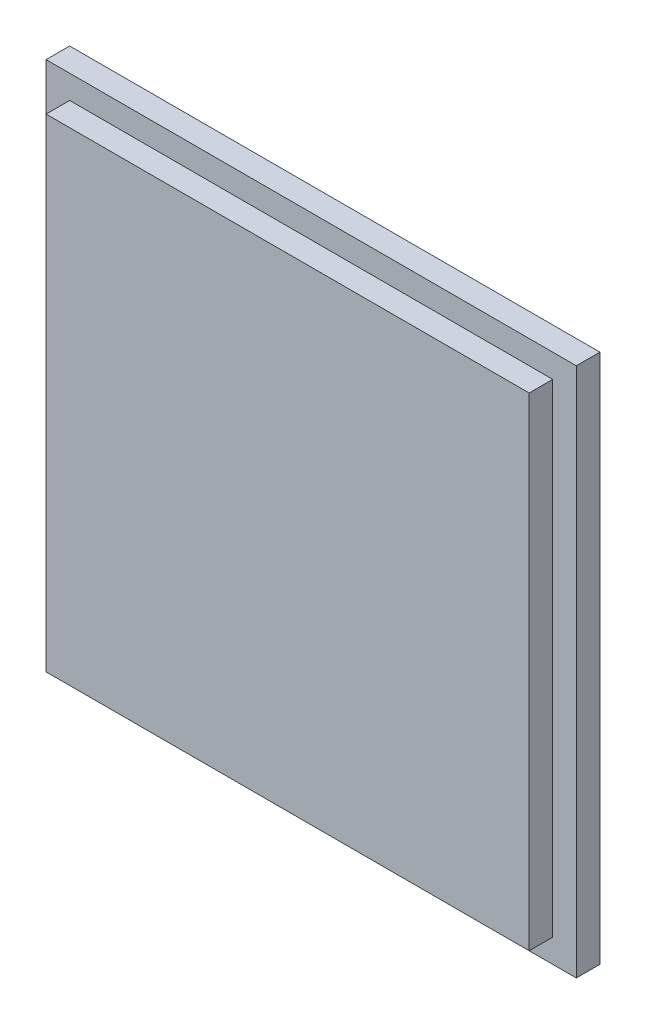
ISO-10303-21;
HEADER;
FILE_DESCRIPTION(('STEP AP214'),'2;1');
FILE_NAME('part.step','',(''),(''),'','','');
FILE_SCHEMA(('AUTOMOTIVE_DESIGN { 1 0 10303 214 1 1 1 1 }'));
ENDSEC;
DATA;
#1=APPLICATION_CONTEXT('core data for automotive mechanical design processes');
#2=APPLICATION_PROTOCOL_DEFINITION('international standard','automotive_design',2000,#1);
#3=PRODUCT_CONTEXT('',#1,'mechanical');
#4=PRODUCT('Part','Part','',(#3));
#5=PRODUCT_RELATED_PRODUCT_CATEGORY('part','',(#4));
#6=PRODUCT_DEFINITION_FORMATION('','',#4);
#7=PRODUCT_DEFINITION_CONTEXT('part definition',#1,'design');
#8=PRODUCT_DEFINITION('design','',#6,#7);
#9=PRODUCT_DEFINITION_SHAPE('','',#8);
#10=(LENGTH_UNIT() NAMED_UNIT(*) SI_UNIT(.MILLI.,.METRE.));
#11=(NAMED_UNIT(*) PLANE_ANGLE_UNIT() SI_UNIT($,.RADIAN.));
#12=(NAMED_UNIT(*) SI_UNIT($,.STERADIAN.) SOLID_ANGLE_UNIT());
#13=UNCERTAINTY_MEASURE_WITH_UNIT(LENGTH_MEASURE(1.E-05),#10,'distance_accuracy_value','');
#14=(GEOMETRIC_REPRESENTATION_CONTEXT(3) GLOBAL_UNCERTAINTY_ASSIGNED_CONTEXT((#13)) GLOBAL_UNIT_ASSIGNED_CONTEXT((#10,
#11,#12)) REPRESENTATION_CONTEXT('',''));
#15=CARTESIAN_POINT('',(0.,0.,0.));
#16=DIRECTION('',(0.,0.,1.));
#17=DIRECTION('',(1.,0.,0.));
#18=AXIS2_PLACEMENT_3D('',#15,#16,#17);
#19=CARTESIAN_POINT('',(0.,0.,2.5));
#20=DIRECTION('',(0.,0.,-1.));
#21=DIRECTION('',(-1.,0.,0.));
#22=AXIS2_PLACEMENT_3D('',#19,#20,#21);
#23=PLANE('',#22);
#24=DIRECTION('',(0.,1.,0.));
#25=VECTOR('',#24,1.);
#26=CARTESIAN_POINT('',(28.1,-28.1,2.5));
#27=LINE('',#26,#25);
#28=CARTESIAN_POINT('',(28.1,-28.1,2.5));
#29=VERTEX_POINT('',#28);
#30=CARTESIAN_POINT('',(28.1,28.1,2.5));
#31=VERTEX_POINT('',#30);
#32=EDGE_CURVE('E130',#29,#31,#27,.T.);
#33=ORIENTED_EDGE('',*,*,#32,.T.);
#34=DIRECTION('',(-1.,0.,0.));
#35=VECTOR('',#34,1.);
#36=CARTESIAN_POINT('',(-28.1,28.1,2.5));
#37=LINE('',#36,#35);
#38=CARTESIAN_POINT('',(-28.1,28.1,2.5));
#39=VERTEX_POINT('',#38);
#40=EDGE_CURVE('E133',#31,#39,#37,.T.);
#41=ORIENTED_EDGE('',*,*,#40,.T.);
#42=DIRECTION('',(0.,-1.,0.));
#43=VECTOR('',#42,1.);
#44=CARTESIAN_POINT('',(-28.1,-28.1,2.5));
#45=LINE('',#44,#43);
#46=CARTESIAN_POINT('',(-28.1,-28.1,2.5));
#47=VERTEX_POINT('',#46);
#48=EDGE_CURVE('E136',#39,#47,#45,.T.);
#49=ORIENTED_EDGE('',*,*,#48,.T.);
#50=DIRECTION('',(1.,0.,0.));
#51=VECTOR('',#50,1.);
#52=CARTESIAN_POINT('',(-28.1,-28.1,2.5));
#53=LINE('',#52,#51);
#54=EDGE_CURVE('E138',#47,#29,#53,.T.);
#55=ORIENTED_EDGE('',*,*,#54,.T.);
#56=EDGE_LOOP('',(#33,#41,#49,#55));
#57=FACE_BOUND('',#56,.T.);
#58=DIRECTION('',(0.,1.,0.));
#59=VECTOR('',#58,1.);
#60=CARTESIAN_POINT('',(25.6,-25.6,2.5));
#61=LINE('',#60,#59);
#62=CARTESIAN_POINT('',(25.6,-25.6,2.5));
#63=VERTEX_POINT('',#62);
#64=CARTESIAN_POINT('',(25.6,25.6,2.5));
#65=VERTEX_POINT('',#64);
#66=EDGE_CURVE('E51',#63,#65,#61,.T.);
#67=ORIENTED_EDGE('',*,*,#66,.F.);
#68=DIRECTION('',(1.,0.,0.));
#69=VECTOR('',#68,1.);
#70=CARTESIAN_POINT('',(-25.6,-25.6,2.5));
#71=LINE('',#70,#69);
#72=CARTESIAN_POINT('',(-25.6,-25.6,2.5));
#73=VERTEX_POINT('',#72);
#74=EDGE_CURVE('E55',#73,#63,#71,.T.);
#75=ORIENTED_EDGE('',*,*,#74,.F.);
#76=DIRECTION('',(0.,-1.,0.));
#77=VECTOR('',#76,1.);
#78=CARTESIAN_POINT('',(-25.6,-25.6,2.5));
#79=LINE('',#78,#77);
#80=CARTESIAN_POINT('',(-25.6,25.6,2.5));
#81=VERTEX_POINT('',#80);
#82=EDGE_CURVE('E263',#81,#73,#79,.T.);
#83=ORIENTED_EDGE('',*,*,#82,.F.);
#84=DIRECTION('',(-1.,0.,0.));
#85=VECTOR('',#84,1.);
#86=CARTESIAN_POINT('',(-25.6,25.6,2.5));
#87=LINE('',#86,#85);
#88=EDGE_CURVE('E269',#65,#81,#87,.T.);
#89=ORIENTED_EDGE('',*,*,#88,.F.);
#90=EDGE_LOOP('',(#67,#75,#83,#89));
#91=FACE_BOUND('',#90,.T.);
#92=ADVANCED_FACE('F36',(#57,#91),#23,.F.);
#93=CARTESIAN_POINT('',(28.1,-28.1,2.5));
#94=DIRECTION('',(-1.,0.,0.));
#95=DIRECTION('',(0.,0.,1.));
#96=AXIS2_PLACEMENT_3D('',#93,#94,#95);
#97=PLANE('',#96);
#98=DIRECTION('',(0.,1.,0.));
#99=VECTOR('',#98,1.);
#100=CARTESIAN_POINT('',(28.1,-28.1,0.));
#101=LINE('',#100,#99);
#102=CARTESIAN_POINT('',(28.1,-28.1,0.));
#103=VERTEX_POINT('',#102);
#104=CARTESIAN_POINT('',(28.1,28.1,0.));
#105=VERTEX_POINT('',#104);
#106=EDGE_CURVE('E121',#103,#105,#101,.T.);
#107=ORIENTED_EDGE('',*,*,#106,.T.);
#108=DIRECTION('',(0.,0.,-1.));
#109=VECTOR('',#108,1.);
#110=CARTESIAN_POINT('',(28.1,28.1,2.5));
#111=LINE('',#110,#109);
#112=EDGE_CURVE('E11',#31,#105,#111,.T.);
#113=ORIENTED_EDGE('',*,*,#112,.F.);
#114=ORIENTED_EDGE('',*,*,#32,.F.);
#115=DIRECTION('',(0.,0.,-1.));
#116=VECTOR('',#115,1.);
#117=CARTESIAN_POINT('',(28.1,-28.1,2.5));
#118=LINE('',#117,#116);
#119=EDGE_CURVE('E139',#29,#103,#118,.T.);
#120=ORIENTED_EDGE('',*,*,#119,.T.);
#121=EDGE_LOOP('',(#107,#113,#114,#120));
#122=FACE_BOUND('',#121,.T.);
#123=ADVANCED_FACE('F38',(#122),#97,.F.);
#124=CARTESIAN_POINT('',(-28.1,28.1,2.5));
#125=DIRECTION('',(0.,-1.,0.));
#126=DIRECTION('',(0.,0.,-1.));
#127=AXIS2_PLACEMENT_3D('',#124,#125,#126);
#128=PLANE('',#127);
#129=DIRECTION('',(-1.,0.,0.));
#130=VECTOR('',#129,1.);
#131=CARTESIAN_POINT('',(-28.1,28.1,0.));
#132=LINE('',#131,#130);
#133=CARTESIAN_POINT('',(-28.1,28.1,0.));
#134=VERTEX_POINT('',#133);
#135=EDGE_CURVE('E124',#105,#134,#132,.T.);
#136=ORIENTED_EDGE('',*,*,#135,.T.);
#137=DIRECTION('',(0.,0.,-1.));
#138=VECTOR('',#137,1.);
#139=CARTESIAN_POINT('',(-28.1,28.1,2.5));
#140=LINE('',#139,#138);
#141=EDGE_CURVE('E44',#39,#134,#140,.T.);
#142=ORIENTED_EDGE('',*,*,#141,.F.);
#143=ORIENTED_EDGE('',*,*,#40,.F.);
#144=ORIENTED_EDGE('',*,*,#112,.T.);
#145=EDGE_LOOP('',(#136,#142,#143,#144));
#146=FACE_BOUND('',#145,.T.);
#147=ADVANCED_FACE('F169',(#146),#128,.F.);
#148=CARTESIAN_POINT('',(-28.1,-28.1,2.5));
#149=DIRECTION('',(1.,0.,0.));
#150=DIRECTION('',(0.,0.,-1.));
#151=AXIS2_PLACEMENT_3D('',#148,#149,#150);
#152=PLANE('',#151);
#153=DIRECTION('',(0.,-1.,0.));
#154=VECTOR('',#153,1.);
#155=CARTESIAN_POINT('',(-28.1,-28.1,0.));
#156=LINE('',#155,#154);
#157=CARTESIAN_POINT('',(-28.1,-28.1,0.));
#158=VERTEX_POINT('',#157);
#159=EDGE_CURVE('E142',#134,#158,#156,.T.);
#160=ORIENTED_EDGE('',*,*,#159,.T.);
#161=DIRECTION('',(0.,0.,-1.));
#162=VECTOR('',#161,1.);
#163=CARTESIAN_POINT('',(-28.1,-28.1,2.5));
#164=LINE('',#163,#162);
#165=EDGE_CURVE('E147',#47,#158,#164,.T.);
#166=ORIENTED_EDGE('',*,*,#165,.F.);
#167=ORIENTED_EDGE('',*,*,#48,.F.);
#168=ORIENTED_EDGE('',*,*,#141,.T.);
#169=EDGE_LOOP('',(#160,#166,#167,#168));
#170=FACE_BOUND('',#169,.T.);
#171=ADVANCED_FACE('F154',(#170),#152,.F.);
#172=CARTESIAN_POINT('',(-28.1,-28.1,2.5));
#173=DIRECTION('',(0.,1.,0.));
#174=DIRECTION('',(-1.,0.,0.));
#175=AXIS2_PLACEMENT_3D('',#172,#173,#174);
#176=PLANE('',#175);
#177=DIRECTION('',(1.,0.,0.));
#178=VECTOR('',#177,1.);
#179=CARTESIAN_POINT('',(-28.1,-28.1,0.));
#180=LINE('',#179,#178);
#181=EDGE_CURVE('E134',#158,#103,#180,.T.);
#182=ORIENTED_EDGE('',*,*,#181,.T.);
#183=ORIENTED_EDGE('',*,*,#119,.F.);
#184=ORIENTED_EDGE('',*,*,#54,.F.);
#185=ORIENTED_EDGE('',*,*,#165,.T.);
#186=EDGE_LOOP('',(#182,#183,#184,#185));
#187=FACE_BOUND('',#186,.T.);
#188=ADVANCED_FACE('F163',(#187),#176,.F.);
#189=CARTESIAN_POINT('',(0.,0.,0.));
#190=DIRECTION('',(0.,0.,-1.));
#191=DIRECTION('',(-1.,0.,0.));
#192=AXIS2_PLACEMENT_3D('',#189,#190,#191);
#193=PLANE('',#192);
#194=ORIENTED_EDGE('',*,*,#106,.F.);
#195=ORIENTED_EDGE('',*,*,#181,.F.);
#196=ORIENTED_EDGE('',*,*,#159,.F.);
#197=ORIENTED_EDGE('',*,*,#135,.F.);
#198=EDGE_LOOP('',(#194,#195,#196,#197));
#199=FACE_BOUND('',#198,.T.);
#200=ADVANCED_FACE('F160',(#199),#193,.T.);
#201=CARTESIAN_POINT('',(25.6,-25.6,5.));
#202=DIRECTION('',(-1.,0.,0.));
#203=DIRECTION('',(0.,0.,1.));
#204=AXIS2_PLACEMENT_3D('',#201,#202,#203);
#205=PLANE('',#204);
#206=ORIENTED_EDGE('',*,*,#66,.T.);
#207=DIRECTION('',(0.,0.,-1.));
#208=VECTOR('',#207,1.);
#209=CARTESIAN_POINT('',(25.6,25.6,5.));
#210=LINE('',#209,#208);
#211=CARTESIAN_POINT('',(25.6,25.6,5.));
#212=VERTEX_POINT('',#211);
#213=EDGE_CURVE('E104',#212,#65,#210,.T.);
#214=ORIENTED_EDGE('',*,*,#213,.F.);
#215=DIRECTION('',(0.,1.,0.));
#216=VECTOR('',#215,1.);
#217=CARTESIAN_POINT('',(25.6,-25.6,5.));
#218=LINE('',#217,#216);
#219=CARTESIAN_POINT('',(25.6,-25.6,5.));
#220=VERTEX_POINT('',#219);
#221=EDGE_CURVE('E110',#220,#212,#218,.T.);
#222=ORIENTED_EDGE('',*,*,#221,.F.);
#223=DIRECTION('',(0.,0.,-1.));
#224=VECTOR('',#223,1.);
#225=CARTESIAN_POINT('',(25.6,-25.6,5.));
#226=LINE('',#225,#224);
#227=EDGE_CURVE('E261',#220,#63,#226,.T.);
#228=ORIENTED_EDGE('',*,*,#227,.T.);
#229=EDGE_LOOP('',(#206,#214,#222,#228));
#230=FACE_BOUND('',#229,.T.);
#231=ADVANCED_FACE('F120',(#230),#205,.F.);
#232=CARTESIAN_POINT('',(-25.6,25.6,5.));
#233=DIRECTION('',(0.,-1.,0.));
#234=DIRECTION('',(0.,0.,-1.));
#235=AXIS2_PLACEMENT_3D('',#232,#233,#234);
#236=PLANE('',#235);
#237=ORIENTED_EDGE('',*,*,#88,.T.);
#238=DIRECTION('',(0.,0.,-1.));
#239=VECTOR('',#238,1.);
#240=CARTESIAN_POINT('',(-25.6,25.6,5.));
#241=LINE('',#240,#239);
#242=CARTESIAN_POINT('',(-25.6,25.6,5.));
#243=VERTEX_POINT('',#242);
#244=EDGE_CURVE('E106',#243,#81,#241,.T.);
#245=ORIENTED_EDGE('',*,*,#244,.F.);
#246=DIRECTION('',(-1.,0.,0.));
#247=VECTOR('',#246,1.);
#248=CARTESIAN_POINT('',(-25.6,25.6,5.));
#249=LINE('',#248,#247);
#250=EDGE_CURVE('E99',#212,#243,#249,.T.);
#251=ORIENTED_EDGE('',*,*,#250,.F.);
#252=ORIENTED_EDGE('',*,*,#213,.T.);
#253=EDGE_LOOP('',(#237,#245,#251,#252));
#254=FACE_BOUND('',#253,.T.);
#255=ADVANCED_FACE('F102',(#254),#236,.F.);
#256=CARTESIAN_POINT('',(-25.6,-25.6,5.));
#257=DIRECTION('',(1.,0.,0.));
#258=DIRECTION('',(0.,0.,-1.));
#259=AXIS2_PLACEMENT_3D('',#256,#257,#258);
#260=PLANE('',#259);
#261=ORIENTED_EDGE('',*,*,#82,.T.);
#262=DIRECTION('',(0.,0.,-1.));
#263=VECTOR('',#262,1.);
#264=CARTESIAN_POINT('',(-25.6,-25.6,5.));
#265=LINE('',#264,#263);
#266=CARTESIAN_POINT('',(-25.6,-25.6,5.));
#267=VERTEX_POINT('',#266);
#268=EDGE_CURVE('E126',#267,#73,#265,.T.);
#269=ORIENTED_EDGE('',*,*,#268,.F.);
#270=DIRECTION('',(0.,-1.,0.));
#271=VECTOR('',#270,1.);
#272=CARTESIAN_POINT('',(-25.6,-25.6,5.));
#273=LINE('',#272,#271);
#274=EDGE_CURVE('E109',#243,#267,#273,.T.);
#275=ORIENTED_EDGE('',*,*,#274,.F.);
#276=ORIENTED_EDGE('',*,*,#244,.T.);
#277=EDGE_LOOP('',(#261,#269,#275,#276));
#278=FACE_BOUND('',#277,.T.);
#279=ADVANCED_FACE('F205',(#278),#260,.F.);
#280=CARTESIAN_POINT('',(-25.6,-25.6,5.));
#281=DIRECTION('',(0.,1.,0.));
#282=DIRECTION('',(0.,0.,1.));
#283=AXIS2_PLACEMENT_3D('',#280,#281,#282);
#284=PLANE('',#283);
#285=ORIENTED_EDGE('',*,*,#74,.T.);
#286=ORIENTED_EDGE('',*,*,#227,.F.);
#287=DIRECTION('',(1.,0.,0.));
#288=VECTOR('',#287,1.);
#289=CARTESIAN_POINT('',(-25.6,-25.6,5.));
#290=LINE('',#289,#288);
#291=EDGE_CURVE('E115',#267,#220,#290,.T.);
#292=ORIENTED_EDGE('',*,*,#291,.F.);
#293=ORIENTED_EDGE('',*,*,#268,.T.);
#294=EDGE_LOOP('',(#285,#286,#292,#293));
#295=FACE_BOUND('',#294,.T.);
#296=ADVANCED_FACE('F211',(#295),#284,.F.);
#297=CARTESIAN_POINT('',(0.,0.,5.));
#298=DIRECTION('',(0.,0.,-1.));
#299=DIRECTION('',(-1.,0.,0.));
#300=AXIS2_PLACEMENT_3D('',#297,#298,#299);
#301=PLANE('',#300);
#302=ORIENTED_EDGE('',*,*,#221,.T.);
#303=ORIENTED_EDGE('',*,*,#250,.T.);
#304=ORIENTED_EDGE('',*,*,#274,.T.);
#305=ORIENTED_EDGE('',*,*,#291,.T.);
#306=EDGE_LOOP('',(#302,#303,#304,#305));
#307=FACE_BOUND('',#306,.T.);
#308=ADVANCED_FACE('F113',(#307),#301,.F.);
#309=CLOSED_SHELL('',(#92,#123,#147,#171,#188,#200,#231,#255,#279,#296,#308));
#310=MANIFOLD_SOLID_BREP('B2',#309);
#311=ADVANCED_BREP_SHAPE_REPRESENTATION('',(#18,#310),#14);
#312=SHAPE_DEFINITION_REPRESENTATION(#9,#311);
ENDSEC;
END-ISO-10303-21;
